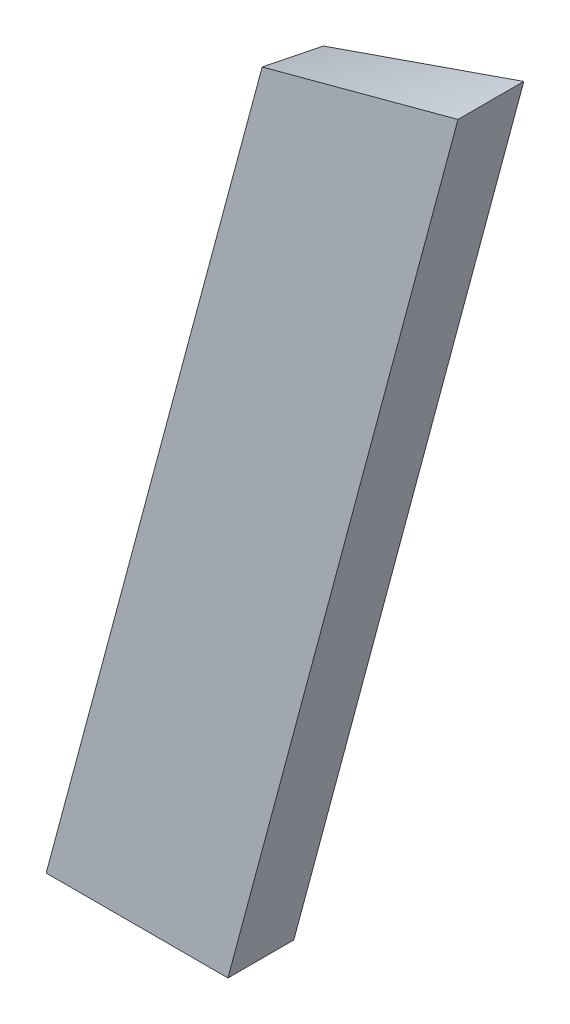
ISO-10303-21;
HEADER;
FILE_DESCRIPTION(('STEP AP214'),'2;1');
FILE_NAME('part.step','',(''),(''),'','','');
FILE_SCHEMA(('AUTOMOTIVE_DESIGN { 1 0 10303 214 1 1 1 1 }'));
ENDSEC;
DATA;
#1=APPLICATION_CONTEXT('core data for automotive mechanical design processes');
#2=APPLICATION_PROTOCOL_DEFINITION('international standard','automotive_design',2000,#1);
#3=PRODUCT_CONTEXT('',#1,'mechanical');
#4=PRODUCT('Part','Part','',(#3));
#5=PRODUCT_RELATED_PRODUCT_CATEGORY('part','',(#4));
#6=PRODUCT_DEFINITION_FORMATION('','',#4);
#7=PRODUCT_DEFINITION_CONTEXT('part definition',#1,'design');
#8=PRODUCT_DEFINITION('design','',#6,#7);
#9=PRODUCT_DEFINITION_SHAPE('','',#8);
#10=(LENGTH_UNIT() NAMED_UNIT(*) SI_UNIT(.MILLI.,.METRE.));
#11=(NAMED_UNIT(*) PLANE_ANGLE_UNIT() SI_UNIT($,.RADIAN.));
#12=(NAMED_UNIT(*) SI_UNIT($,.STERADIAN.) SOLID_ANGLE_UNIT());
#13=UNCERTAINTY_MEASURE_WITH_UNIT(LENGTH_MEASURE(1.E-05),#10,'distance_accuracy_value','');
#14=(GEOMETRIC_REPRESENTATION_CONTEXT(3) GLOBAL_UNCERTAINTY_ASSIGNED_CONTEXT((#13)) GLOBAL_UNIT_ASSIGNED_CONTEXT((#10,
#11,#12)) REPRESENTATION_CONTEXT('',''));
#15=CARTESIAN_POINT('',(0.,0.,0.));
#16=DIRECTION('',(0.,0.,1.));
#17=DIRECTION('',(1.,0.,0.));
#18=AXIS2_PLACEMENT_3D('',#15,#16,#17);
#19=CARTESIAN_POINT('',(66.5617879242416,248.411974375891,19.05));
#20=DIRECTION('',(0.965925826289067,-0.258819045102524,0.));
#21=DIRECTION('',(0.258819045102524,0.965925826289068,0.));
#22=AXIS2_PLACEMENT_3D('',#19,#20,#21);
#23=PLANE('',#22);
#24=CARTESIAN_POINT('',(55.7835203918196,208.186958086938,-19.0500014232511));
#25=CARTESIAN_POINT('',(55.8935850880123,208.597924771428,-17.4625180647381));
#26=CARTESIAN_POINT('',(56.0036696762821,209.008830224662,-15.8750202373842));
#27=CARTESIAN_POINT('',(56.223854772154,209.830589423075,-12.7000184431612));
#28=CARTESIAN_POINT('',(56.3339552796972,210.241443168435,-11.1125144763351));
#29=CARTESIAN_POINT('',(56.5541492558858,211.063173088119,-7.93751013048446));
#30=CARTESIAN_POINT('',(56.664242724524,211.474049262465,-6.35000975146522));
#31=CARTESIAN_POINT('',(56.8844146973927,212.295849852857,-3.17501549777399));
#32=CARTESIAN_POINT('',(56.9944932015788,212.70677426904,-1.5875216231343));
#33=CARTESIAN_POINT('',(57.2146398634656,213.528656294446,1.58746130415315));
#34=CARTESIAN_POINT('',(57.3247080211473,213.939613903729,3.17495035678715));
#35=CARTESIAN_POINT('',(57.5448528638194,214.76150105361,6.34993100506317));
#36=CARTESIAN_POINT('',(57.6549295487883,215.172430594274,7.93742260068967));
#37=CARTESIAN_POINT('',(57.8751230633056,215.99415881586,11.1124203394817));
#38=CARTESIAN_POINT('',(57.9852398924532,216.404957498016,12.6999264823556));
#39=CARTESIAN_POINT('',(58.2055615700847,217.226268964489,15.8749727147502));
#40=CARTESIAN_POINT('',(58.3157664167714,217.636781754337,17.4625128029645));
#41=CARTESIAN_POINT('',(58.4260408670203,218.047080268642,19.0501034708053));
#42=B_SPLINE_CURVE_WITH_KNOTS('',3,(#24,#25,#26,#27,#28,#29,#30,#31,#32,#33,#34,#35,#36,#37,#38,
#39,#40,#41),.UNSPECIFIED.,.F.,.F.,(4,2,2,2,2,2,2,2,4),(0.,4.93051735071589,9.86101690882174,
14.7915214772327,19.7220403736753,24.6525681170297,29.5830838900509,34.5135517201267,
39.4439213250793),.UNSPECIFIED.);
#43=CARTESIAN_POINT('',(58.4256328193832,218.047430146299,19.05));
#44=VERTEX_POINT('',#43);
#45=CARTESIAN_POINT('',(55.7835222370166,208.186952093499,-19.0500007116255));
#46=VERTEX_POINT('',#45);
#47=EDGE_CURVE('E100',#44,#46,#42,.F.);
#48=ORIENTED_EDGE('',*,*,#47,.T.);
#49=DIRECTION('',(-0.258819045102524,-0.965925826289067,0.));
#50=VECTOR('',#49,1.);
#51=CARTESIAN_POINT('',(66.5617879242416,248.411974375891,-19.05));
#52=LINE('',#51,#50);
#53=CARTESIAN_POINT('',(-66.5617879242418,-248.411974375891,-19.05));
#54=VERTEX_POINT('',#53);
#55=EDGE_CURVE('E99',#46,#54,#52,.T.);
#56=ORIENTED_EDGE('',*,*,#55,.T.);
#57=DIRECTION('',(0.,0.,-1.));
#58=VECTOR('',#57,1.);
#59=CARTESIAN_POINT('',(-66.5617879242418,-248.411974375891,19.05));
#60=LINE('',#59,#58);
#61=CARTESIAN_POINT('',(-66.5617879242418,-248.411974375891,19.05));
#62=VERTEX_POINT('',#61);
#63=EDGE_CURVE('E11',#62,#54,#60,.T.);
#64=ORIENTED_EDGE('',*,*,#63,.F.);
#65=DIRECTION('',(-0.258819045102524,-0.965925826289067,0.));
#66=VECTOR('',#65,1.);
#67=CARTESIAN_POINT('',(66.5617879242416,248.411974375891,19.05));
#68=LINE('',#67,#66);
#69=EDGE_CURVE('E105',#44,#62,#68,.T.);
#70=ORIENTED_EDGE('',*,*,#69,.F.);
#71=EDGE_LOOP('',(#48,#56,#64,#70));
#72=FACE_BOUND('',#71,.T.);
#73=ADVANCED_FACE('F35',(#72),#23,.F.);
#74=CARTESIAN_POINT('',(0.,0.,19.05));
#75=DIRECTION('',(0.,0.,1.));
#76=DIRECTION('',(1.,0.,0.));
#77=AXIS2_PLACEMENT_3D('',#74,#75,#76);
#78=PLANE('',#77);
#79=DIRECTION('',(0.258819045102525,0.965925826289067,0.));
#80=VECTOR('',#79,1.);
#81=CARTESIAN_POINT('',(38.6222720054228,-248.411974375891,19.05));
#82=LINE('',#81,#80);
#83=CARTESIAN_POINT('',(38.6222720054228,-248.411974375891,19.05));
#84=VERTEX_POINT('',#83);
#85=CARTESIAN_POINT('',(171.74460527014,248.411974375891,19.05));
#86=VERTEX_POINT('',#85);
#87=EDGE_CURVE('E116',#84,#86,#82,.T.);
#88=ORIENTED_EDGE('',*,*,#87,.T.);
#89=CARTESIAN_POINT('',(58.4260408670202,218.047080268642,19.0501034708053));
#90=CARTESIAN_POINT('',(63.1475259894057,219.312896189222,19.0500269326441));
#91=CARTESIAN_POINT('',(67.8691359693348,220.578246162966,19.0500051717984));
#92=CARTESIAN_POINT('',(77.3124713683562,223.108571149108,19.0500061708032));
#93=CARTESIAN_POINT('',(82.0341967877486,224.373546160387,19.0500289307853));
#94=CARTESIAN_POINT('',(91.4775978725415,226.903669872634,19.050053937186));
#95=CARTESIAN_POINT('',(96.1992735379718,228.168818573492,19.0500561836176));
#96=CARTESIAN_POINT('',(105.642574383072,230.699283045325,19.0500408674834));
#97=CARTESIAN_POINT('',(110.364199562792,231.96459881611,19.05002330494));
#98=CARTESIAN_POINT('',(119.807443992645,234.495249798408,19.0499858732103));
#99=CARTESIAN_POINT('',(124.529063242778,235.760585009919,19.0499660040244));
#100=CARTESIAN_POINT('',(133.972342941167,238.291118858681,19.0499424567237));
#101=CARTESIAN_POINT('',(138.694003389458,239.556317495807,19.0499387786236));
#102=CARTESIAN_POINT('',(148.137372811676,242.086548569679,19.0499510784147));
#103=CARTESIAN_POINT('',(152.85908178564,243.351581006293,19.0499670563215));
#104=CARTESIAN_POINT('',(162.302438669197,245.881844224598,19.0499754618126));
#105=CARTESIAN_POINT('',(167.024086578875,247.147075005976,19.0499678894338));
#106=CARTESIAN_POINT('',(171.745658411336,248.412589709943,19.0499269388686));
#107=B_SPLINE_CURVE_WITH_KNOTS('',3,(#89,#90,#91,#92,#93,#94,#95,#96,#97,#98,#99,#100,#101,#102,
#103,#104,#105,#106),.UNSPECIFIED.,.F.,.F.,(4,2,2,2,2,2,2,2,4),(0.,14.6646651017122,
29.3293735568283,43.99407269743,58.6587552712287,73.3234357609715,87.9881295777512,
102.652834968123,117.317517417392),.UNSPECIFIED.);
#108=EDGE_CURVE('E90',#86,#44,#107,.F.);
#109=ORIENTED_EDGE('',*,*,#108,.T.);
#110=ORIENTED_EDGE('',*,*,#69,.T.);
#111=DIRECTION('',(1.,0.,0.));
#112=VECTOR('',#111,1.);
#113=CARTESIAN_POINT('',(-66.5617879242418,-248.411974375891,19.05));
#114=LINE('',#113,#112);
#115=EDGE_CURVE('E56',#62,#84,#114,.T.);
#116=ORIENTED_EDGE('',*,*,#115,.T.);
#117=EDGE_LOOP('',(#88,#109,#110,#116));
#118=FACE_BOUND('',#117,.T.);
#119=ADVANCED_FACE('F131',(#118),#78,.T.);
#120=CARTESIAN_POINT('',(0.,0.,-19.05));
#121=DIRECTION('',(0.,0.,1.));
#122=DIRECTION('',(1.,0.,0.));
#123=AXIS2_PLACEMENT_3D('',#120,#121,#122);
#124=PLANE('',#123);
#125=CARTESIAN_POINT('',(171.745860367202,248.411933729383,-19.0499951738932));
#126=CARTESIAN_POINT('',(166.914172783219,246.735657905856,-19.0499673558497));
#127=CARTESIAN_POINT('',(162.082441518403,245.059508000613,-19.0499546714779));
#128=CARTESIAN_POINT('',(152.418935713914,241.707348752467,-19.0499459922764));
#129=CARTESIAN_POINT('',(147.58716117429,240.031339409424,-19.0499499974299));
#130=CARTESIAN_POINT('',(137.923604580671,236.679347123184,-19.0499611194752));
#131=CARTESIAN_POINT('',(133.091822526678,235.00336417998,-19.0499682363661));
#132=CARTESIAN_POINT('',(123.428256298818,231.651405574468,-19.0499833301098));
#133=CARTESIAN_POINT('',(118.596472124952,229.975429912159,-19.0499913069626));
#134=CARTESIAN_POINT('',(108.932901500895,226.623485826439,-19.0500081219469));
#135=CARTESIAN_POINT('',(104.101115050704,224.947517403027,-19.0500169600783));
#136=CARTESIAN_POINT('',(94.4375420134566,221.595580330322,-19.0500346172022));
#137=CARTESIAN_POINT('',(89.6057554264002,219.919611681028,-19.0500434361946));
#138=CARTESIAN_POINT('',(79.9421940008826,216.567634456978,-19.0500563538809));
#139=CARTESIAN_POINT('',(75.1104191624267,214.891625882206,-19.050060452573));
#140=CARTESIAN_POINT('',(65.4469199077677,211.539444954609,-19.0500492039186));
#141=CARTESIAN_POINT('',(60.6151954916308,209.863272601592,-19.0500338565492));
#142=CARTESIAN_POINT('',(55.7835203918196,208.186958086938,-19.0500014232511));
#143=B_SPLINE_CURVE_WITH_KNOTS('',3,(#125,#126,#127,#128,#129,#130,#131,#132,#133,#134,#135,
#136,#137,#138,#139,#140,#141,#142),.UNSPECIFIED.,.F.,.F.,(4,2,2,2,2,2,2,2,4),(0.,
15.3426187363095,30.6852219257411,46.0278204605547,61.3704178452732,76.7130145650671,
92.0556118954299,107.398215175917,122.740836572417),.UNSPECIFIED.);
#144=CARTESIAN_POINT('',(171.745915629318,248.411964183368,-19.0499987898));
#145=VERTEX_POINT('',#144);
#146=EDGE_CURVE('E81',#46,#145,#143,.F.);
#147=ORIENTED_EDGE('',*,*,#146,.T.);
#148=DIRECTION('',(0.258819045102525,0.965925826289067,0.));
#149=VECTOR('',#148,1.);
#150=CARTESIAN_POINT('',(38.6222720054228,-248.411974375891,-19.05));
#151=LINE('',#150,#149);
#152=CARTESIAN_POINT('',(38.6222720054228,-248.411974375891,-19.05));
#153=VERTEX_POINT('',#152);
#154=EDGE_CURVE('E98',#153,#145,#151,.T.);
#155=ORIENTED_EDGE('',*,*,#154,.F.);
#156=DIRECTION('',(1.,0.,0.));
#157=VECTOR('',#156,1.);
#158=CARTESIAN_POINT('',(-66.5617879242418,-248.411974375891,-19.05));
#159=LINE('',#158,#157);
#160=EDGE_CURVE('E68',#54,#153,#159,.T.);
#161=ORIENTED_EDGE('',*,*,#160,.F.);
#162=ORIENTED_EDGE('',*,*,#55,.F.);
#163=EDGE_LOOP('',(#147,#155,#161,#162));
#164=FACE_BOUND('',#163,.T.);
#165=ADVANCED_FACE('F97',(#164),#124,.F.);
#166=CARTESIAN_POINT('',(-66.5617879242418,-248.411974375891,19.05));
#167=DIRECTION('',(0.,1.,0.));
#168=DIRECTION('',(0.,0.,1.));
#169=AXIS2_PLACEMENT_3D('',#166,#167,#168);
#170=PLANE('',#169);
#171=ORIENTED_EDGE('',*,*,#160,.T.);
#172=DIRECTION('',(0.,0.,-1.));
#173=VECTOR('',#172,1.);
#174=CARTESIAN_POINT('',(38.6222720054228,-248.411974375891,19.05));
#175=LINE('',#174,#173);
#176=EDGE_CURVE('E47',#84,#153,#175,.T.);
#177=ORIENTED_EDGE('',*,*,#176,.F.);
#178=ORIENTED_EDGE('',*,*,#115,.F.);
#179=ORIENTED_EDGE('',*,*,#63,.T.);
#180=EDGE_LOOP('',(#171,#177,#178,#179));
#181=FACE_BOUND('',#180,.T.);
#182=ADVANCED_FACE('F146',(#181),#170,.F.);
#183=CARTESIAN_POINT('',(38.6222720054228,-248.411974375891,19.05));
#184=DIRECTION('',(-0.965925826289067,0.258819045102525,0.));
#185=DIRECTION('',(-0.258819045102525,-0.965925826289067,0.));
#186=AXIS2_PLACEMENT_3D('',#183,#184,#185);
#187=PLANE('',#186);
#188=ORIENTED_EDGE('',*,*,#154,.T.);
#189=CARTESIAN_POINT('',(171.745847853906,248.411974375891,16.2695081891659));
#190=CARTESIAN_POINT('',(171.745918650376,248.411744419768,14.7978775916407));
#191=CARTESIAN_POINT('',(171.745954123177,248.411629199505,13.3262469861354));
#192=CARTESIAN_POINT('',(171.745983826454,248.411532719406,10.3829698693445));
#193=CARTESIAN_POINT('',(171.745978056485,248.411551461016,8.91132335805882));
#194=CARTESIAN_POINT('',(171.74595467893,248.41162739435,5.96802493796619));
#195=CARTESIAN_POINT('',(171.745937071301,248.411684586214,4.49637302915929));
#196=CARTESIAN_POINT('',(171.745906441807,248.411784074784,1.55307040379161));
#197=CARTESIAN_POINT('',(171.745893419939,248.411826371503,0.0814196872308229));
#198=CARTESIAN_POINT('',(171.745879431498,248.411871807773,-2.86187772464614));
#199=CARTESIAN_POINT('',(171.745878464894,248.411874947431,-4.33352441996233));
#200=CARTESIAN_POINT('',(171.745886287983,248.411849537021,-7.27681458823202));
#201=CARTESIAN_POINT('',(171.745895077656,248.411820987022,-8.74845806118554));
#202=CARTESIAN_POINT('',(171.745911702258,248.411766988157,-11.6917460880764));
#203=CARTESIAN_POINT('',(171.745919537187,248.411741539292,-13.1633906420137));
#204=CARTESIAN_POINT('',(171.745912460538,248.411764525165,-16.1066885224681));
#205=CARTESIAN_POINT('',(171.745897548826,248.411812960342,-17.5783418489853));
#206=CARTESIAN_POINT('',(171.745860367674,248.411933729547,-19.0499951738932));
#207=B_SPLINE_CURVE_WITH_KNOTS('',3,(#189,#190,#191,#192,#193,#194,#195,#196,#197,#198,#199,
#200,#201,#202,#203,#204,#205,#206),.UNSPECIFIED.,.F.,.F.,(4,2,2,2,2,2,2,2,4),(0.,
4.41489183092296,8.82983136000569,13.24478709117,17.6597392422723,22.0746793275947,
26.4896097476685,30.9045434087192,35.3195033913498),.UNSPECIFIED.);
#208=CARTESIAN_POINT('',(171.745847853906,248.411974375891,16.2695081891659));
#209=VERTEX_POINT('',#208);
#210=EDGE_CURVE('E75',#209,#145,#207,.T.);
#211=ORIENTED_EDGE('',*,*,#210,.F.);
#212=CARTESIAN_POINT('',(171.743362686374,248.411974375891,19.05));
#213=CARTESIAN_POINT('',(171.743468807493,248.411966020557,18.9341470324285));
#214=CARTESIAN_POINT('',(171.743574575553,248.411958811613,18.8182940644527));
#215=CARTESIAN_POINT('',(171.743785429758,248.411946608669,18.5865878655111));
#216=CARTESIAN_POINT('',(171.743890515903,248.411941614675,18.4707346345453));
#217=CARTESIAN_POINT('',(171.744100030231,248.411933763825,18.2390279188278));
#218=CARTESIAN_POINT('',(171.744204458414,248.411930906975,18.1231744340761));
#219=CARTESIAN_POINT('',(171.744412680228,248.411927254379,17.8914672198242));
#220=CARTESIAN_POINT('',(171.744516473859,248.411926458638,17.7756134903239));
#221=CARTESIAN_POINT('',(171.744723449582,248.411926853507,17.5439057954476));
#222=CARTESIAN_POINT('',(171.744826631674,248.411928044121,17.4280518300716));
#223=CARTESIAN_POINT('',(171.745032406893,248.411932338386,17.1963436721519));
#224=CARTESIAN_POINT('',(171.745135000019,248.411935442039,17.0804894796083));
#225=CARTESIAN_POINT('',(171.745339619485,248.411943490341,16.8487808758981));
#226=CARTESIAN_POINT('',(171.745441645823,248.411948434992,16.7329264647316));
#227=CARTESIAN_POINT('',(171.745645153357,248.411960094993,16.501217432156));
#228=CARTESIAN_POINT('',(171.745746634551,248.411966810345,16.3853628107469));
#229=CARTESIAN_POINT('',(171.745847853906,248.411974375891,16.2695081891659));
#230=B_SPLINE_CURVE_WITH_KNOTS('',3,(#212,#213,#214,#215,#216,#217,#218,#219,#220,#221,#222,
#223,#224,#225,#226,#227,#228,#229),.UNSPECIFIED.,.F.,.F.,(4,2,2,2,2,2,2,2,4),(0.,
0.347559049419681,0.695118885596689,1.04267948113113,1.39024080910413,1.73780284307705,
2.08536555709083,2.43292892566498,2.78049292379699),.UNSPECIFIED.);
#231=EDGE_CURVE('E86',#86,#209,#230,.T.);
#232=ORIENTED_EDGE('',*,*,#231,.F.);
#233=ORIENTED_EDGE('',*,*,#87,.F.);
#234=ORIENTED_EDGE('',*,*,#176,.T.);
#235=EDGE_LOOP('',(#188,#211,#232,#233,#234));
#236=FACE_BOUND('',#235,.T.);
#237=ADVANCED_FACE('F103',(#236),#187,.F.);
#238=CARTESIAN_POINT('',(51.6640973339693,216.309962431737,19.3513459692828));
#239=CARTESIAN_POINT('',(52.2942544683107,214.483733403222,11.5035682108762));
#240=CARTESIAN_POINT('',(52.912398833663,212.696523407498,3.6511575629574));
#241=CARTESIAN_POINT('',(53.5161225096396,210.9561536825,-4.20681462207486));
#242=CARTESIAN_POINT('',(54.1070668012148,209.25729305665,-12.0697153523926));
#243=CARTESIAN_POINT('',(54.6864066566091,207.596125145634,-19.9370914930613));
#244=CARTESIAN_POINT('',(75.8910631738377,222.872013187423,19.6530449650291));
#245=CARTESIAN_POINT('',(76.4108142545754,221.404397350406,11.7626875941874));
#246=CARTESIAN_POINT('',(76.9188505794447,219.974832560886,3.86781226669048));
#247=CARTESIAN_POINT('',(77.4173607629353,218.576209914945,-4.03073694819459));
#248=CARTESIAN_POINT('',(77.9055575782502,217.21108642739,-11.9332636553048));
#249=CARTESIAN_POINT('',(78.3823038188068,215.883155892799,-19.8402064339932));
#250=CARTESIAN_POINT('',(100.136312015778,229.37467837946,19.9617950518796));
#251=CARTESIAN_POINT('',(100.537299339422,228.292822639612,12.0256348053496));
#252=CARTESIAN_POINT('',(100.933661825479,227.22598897249,4.08769092662247));
#253=CARTESIAN_POINT('',(101.32349776501,226.180354375554,-3.85277000449952));
#254=CARTESIAN_POINT('',(101.70627921018,225.157633691895,-11.7959515983574));
#255=CARTESIAN_POINT('',(102.082900129563,224.154923195553,-19.7415090836797));
#256=CARTESIAN_POINT('',(124.38234793744,235.874787034413,20.2708486868448));
#257=CARTESIAN_POINT('',(124.674862206842,235.145265853253,12.2928543156587));
#258=CARTESIAN_POINT('',(124.960041047545,234.439571096556,4.31203093554773));
#259=CARTESIAN_POINT('',(125.240279746734,233.749922560673,-3.67069767805573));
#260=CARTESIAN_POINT('',(125.515602804736,233.076240665356,-11.6553220762632));
#261=CARTESIAN_POINT('',(125.784966462116,232.421915676719,-19.6422447992504));
#262=CARTESIAN_POINT('',(148.64772359275,242.312077724405,20.5873609559747));
#263=CARTESIAN_POINT('',(148.822505944589,241.964965091695,12.5639616522015));
#264=CARTESIAN_POINT('',(148.995113196554,241.624917465677,4.5397234912585));
#265=CARTESIAN_POINT('',(149.163031292115,241.300100828253,-3.48632310731785));
#266=CARTESIAN_POINT('',(149.328242949173,240.984075054355,-11.5134134811114));
#267=CARTESIAN_POINT('',(149.491761778746,240.673547803835,-19.5411567170975));
#268=CARTESIAN_POINT('',(172.920985124995,248.723754062618,20.9069145219597));
#269=CARTESIAN_POINT('',(172.979132368257,248.755487400419,12.8385332850635));
#270=CARTESIAN_POINT('',(173.034898607684,248.7949545477,4.7692337813046));
#271=CARTESIAN_POINT('',(173.090605363606,248.834614905124,-3.30008866308571));
#272=CARTESIAN_POINT('',(173.146373886318,248.874074635997,-11.3693872862642));
#273=CARTESIAN_POINT('',(173.200794872827,248.917911339353,-19.4392056053056));
#274=B_SPLINE_SURFACE_WITH_KNOTS('',5,5,((#238,#239,#240,#241,#242,#243),(#244,#245,#246,#247,
#248,#249),(#250,#251,#252,#253,#254,#255),(#256,#257,#258,#259,#260,#261),(#262,#263,#264,#265,
#266,#267),(#268,#269,#270,#271,#272,#273)),.UNSPECIFIED.,.F.,.F.,.F.,(6,6),(6,6),
(-64.0739157724438,61.3566634133075),(-20.2720043245735,19.8064992300345),.UNSPECIFIED.);
#275=ORIENTED_EDGE('',*,*,#231,.T.);
#276=ORIENTED_EDGE('',*,*,#210,.T.);
#277=ORIENTED_EDGE('',*,*,#146,.F.);
#278=ORIENTED_EDGE('',*,*,#47,.F.);
#279=ORIENTED_EDGE('',*,*,#108,.F.);
#280=EDGE_LOOP('',(#275,#276,#277,#278,#279));
#281=FACE_BOUND('',#280,.T.);
#282=ADVANCED_FACE('F78',(#281),#274,.T.);
#283=CLOSED_SHELL('',(#73,#119,#165,#182,#237,#282));
#284=MANIFOLD_SOLID_BREP('B2',#283);
#285=ADVANCED_BREP_SHAPE_REPRESENTATION('',(#18,#284),#14);
#286=SHAPE_DEFINITION_REPRESENTATION(#9,#285);
ENDSEC;
END-ISO-10303-21;
